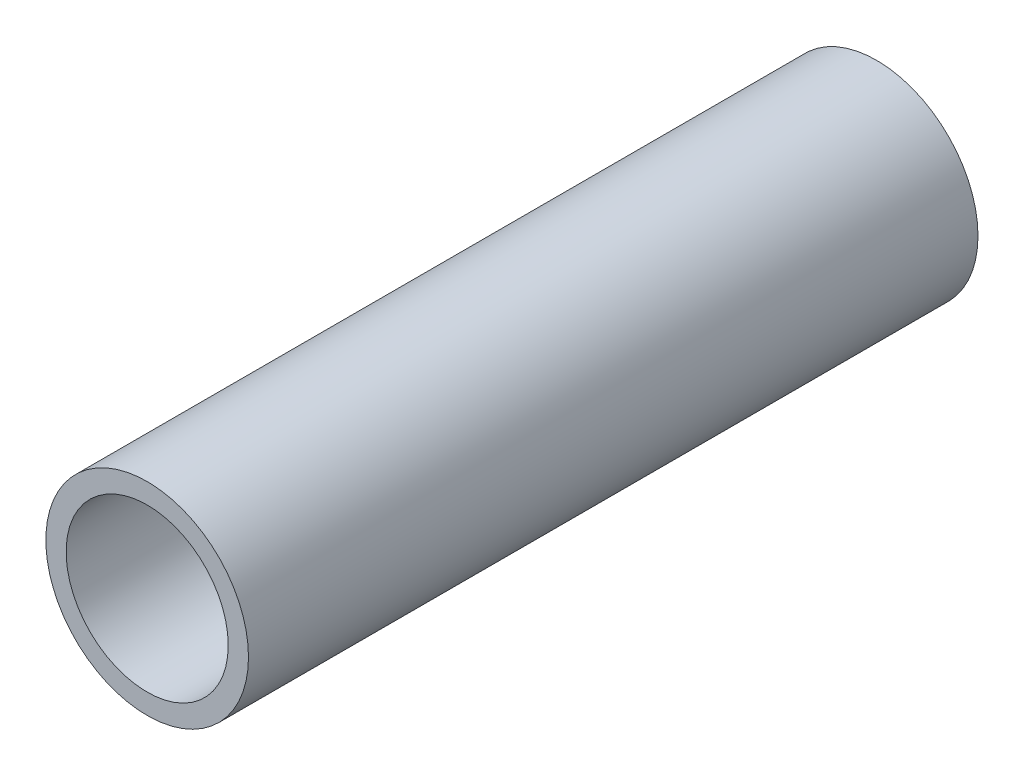
ISO-10303-21;
HEADER;
FILE_DESCRIPTION(('STEP AP214'),'2;1');
FILE_NAME('part.step','',(''),(''),'','','');
FILE_SCHEMA(('AUTOMOTIVE_DESIGN { 1 0 10303 214 1 1 1 1 }'));
ENDSEC;
DATA;
#1=APPLICATION_CONTEXT('core data for automotive mechanical design processes');
#2=APPLICATION_PROTOCOL_DEFINITION('international standard','automotive_design',2000,#1);
#3=PRODUCT_CONTEXT('',#1,'mechanical');
#4=PRODUCT('Part','Part','',(#3));
#5=PRODUCT_RELATED_PRODUCT_CATEGORY('part','',(#4));
#6=PRODUCT_DEFINITION_FORMATION('','',#4);
#7=PRODUCT_DEFINITION_CONTEXT('part definition',#1,'design');
#8=PRODUCT_DEFINITION('design','',#6,#7);
#9=PRODUCT_DEFINITION_SHAPE('','',#8);
#10=(LENGTH_UNIT() NAMED_UNIT(*) SI_UNIT(.MILLI.,.METRE.));
#11=(NAMED_UNIT(*) PLANE_ANGLE_UNIT() SI_UNIT($,.RADIAN.));
#12=(NAMED_UNIT(*) SI_UNIT($,.STERADIAN.) SOLID_ANGLE_UNIT());
#13=UNCERTAINTY_MEASURE_WITH_UNIT(LENGTH_MEASURE(1.E-05),#10,'distance_accuracy_value','');
#14=(GEOMETRIC_REPRESENTATION_CONTEXT(3) GLOBAL_UNCERTAINTY_ASSIGNED_CONTEXT((#13)) GLOBAL_UNIT_ASSIGNED_CONTEXT((#10,
#11,#12)) REPRESENTATION_CONTEXT('',''));
#15=CARTESIAN_POINT('',(0.,0.,0.));
#16=DIRECTION('',(0.,0.,1.));
#17=DIRECTION('',(1.,0.,0.));
#18=AXIS2_PLACEMENT_3D('',#15,#16,#17);
#19=CARTESIAN_POINT('',(0.,0.,9.));
#20=DIRECTION('',(0.,0.,1.));
#21=DIRECTION('',(1.,0.,0.));
#22=AXIS2_PLACEMENT_3D('',#19,#20,#21);
#23=PLANE('',#22);
#24=CARTESIAN_POINT('',(0.,0.,9.));
#25=DIRECTION('',(0.,0.,1.));
#26=DIRECTION('',(1.,0.,0.));
#27=AXIS2_PLACEMENT_3D('',#24,#25,#26);
#28=CIRCLE('',#27,1.25);
#29=CARTESIAN_POINT('',(1.25,0.,9.));
#30=VERTEX_POINT('',#29);
#31=EDGE_CURVE('E10',#30,#30,#28,.T.);
#32=ORIENTED_EDGE('',*,*,#31,.T.);
#33=EDGE_LOOP('',(#32));
#34=FACE_BOUND('',#33,.T.);
#35=CARTESIAN_POINT('',(0.,0.,9.));
#36=DIRECTION('',(0.,0.,1.));
#37=DIRECTION('',(1.,0.,0.));
#38=AXIS2_PLACEMENT_3D('',#35,#36,#37);
#39=CIRCLE('',#38,0.999999999999999);
#40=CARTESIAN_POINT('',(0.999999999999999,0.,9.));
#41=VERTEX_POINT('',#40);
#42=EDGE_CURVE('E41',#41,#41,#39,.T.);
#43=ORIENTED_EDGE('',*,*,#42,.F.);
#44=EDGE_LOOP('',(#43));
#45=FACE_BOUND('',#44,.T.);
#46=ADVANCED_FACE('F30',(#34,#45),#23,.T.);
#47=CARTESIAN_POINT('',(0.,0.,0.));
#48=DIRECTION('',(0.,0.,1.));
#49=DIRECTION('',(1.,0.,0.));
#50=AXIS2_PLACEMENT_3D('',#47,#48,#49);
#51=PLANE('',#50);
#52=CARTESIAN_POINT('',(0.,0.,0.));
#53=DIRECTION('',(0.,0.,1.));
#54=DIRECTION('',(1.,0.,0.));
#55=AXIS2_PLACEMENT_3D('',#52,#53,#54);
#56=CIRCLE('',#55,1.25);
#57=CARTESIAN_POINT('',(1.25,0.,0.));
#58=VERTEX_POINT('',#57);
#59=EDGE_CURVE('E34',#58,#58,#56,.T.);
#60=ORIENTED_EDGE('',*,*,#59,.F.);
#61=EDGE_LOOP('',(#60));
#62=FACE_BOUND('',#61,.T.);
#63=CARTESIAN_POINT('',(0.,0.,0.));
#64=DIRECTION('',(0.,0.,1.));
#65=DIRECTION('',(1.,0.,0.));
#66=AXIS2_PLACEMENT_3D('',#63,#64,#65);
#67=CIRCLE('',#66,0.999999999999999);
#68=CARTESIAN_POINT('',(0.999999999999999,0.,0.));
#69=VERTEX_POINT('',#68);
#70=EDGE_CURVE('E43',#69,#69,#67,.T.);
#71=ORIENTED_EDGE('',*,*,#70,.T.);
#72=EDGE_LOOP('',(#71));
#73=FACE_BOUND('',#72,.T.);
#74=ADVANCED_FACE('F53',(#62,#73),#51,.F.);
#75=CARTESIAN_POINT('',(0.,0.,9.));
#76=DIRECTION('',(0.,0.,-1.));
#77=DIRECTION('',(-1.,0.,0.));
#78=AXIS2_PLACEMENT_3D('',#75,#76,#77);
#79=CYLINDRICAL_SURFACE('',#78,1.25);
#80=ORIENTED_EDGE('',*,*,#31,.F.);
#81=EDGE_LOOP('',(#80));
#82=FACE_BOUND('',#81,.T.);
#83=ORIENTED_EDGE('',*,*,#59,.T.);
#84=EDGE_LOOP('',(#83));
#85=FACE_BOUND('',#84,.T.);
#86=ADVANCED_FACE('F32',(#82,#85),#79,.T.);
#87=CARTESIAN_POINT('',(0.,0.,9.));
#88=DIRECTION('',(0.,0.,-1.));
#89=DIRECTION('',(-1.,0.,0.));
#90=AXIS2_PLACEMENT_3D('',#87,#88,#89);
#91=CYLINDRICAL_SURFACE('',#90,0.999999999999999);
#92=ORIENTED_EDGE('',*,*,#42,.T.);
#93=EDGE_LOOP('',(#92));
#94=FACE_BOUND('',#93,.T.);
#95=ORIENTED_EDGE('',*,*,#70,.F.);
#96=EDGE_LOOP('',(#95));
#97=FACE_BOUND('',#96,.T.);
#98=ADVANCED_FACE('F49',(#94,#97),#91,.F.);
#99=CLOSED_SHELL('',(#46,#74,#86,#98));
#100=MANIFOLD_SOLID_BREP('B2',#99);
#101=ADVANCED_BREP_SHAPE_REPRESENTATION('',(#18,#100),#14);
#102=SHAPE_DEFINITION_REPRESENTATION(#9,#101);
ENDSEC;
END-ISO-10303-21;
